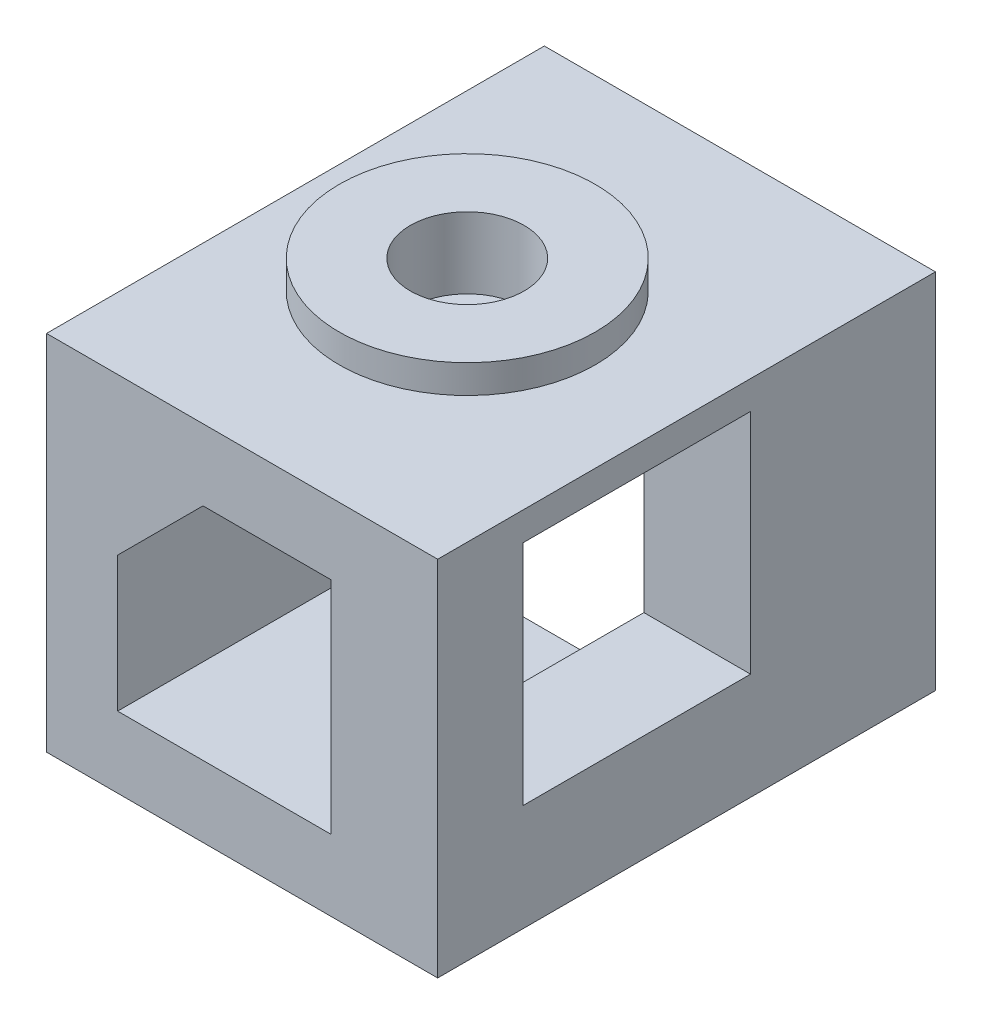
ISO-10303-21;
HEADER;
FILE_DESCRIPTION(('STEP AP214'),'2;1');
FILE_NAME('part.step','',(''),(''),'','','');
FILE_SCHEMA(('AUTOMOTIVE_DESIGN { 1 0 10303 214 1 1 1 1 }'));
ENDSEC;
DATA;
#1=APPLICATION_CONTEXT('core data for automotive mechanical design processes');
#2=APPLICATION_PROTOCOL_DEFINITION('international standard','automotive_design',2000,#1);
#3=PRODUCT_CONTEXT('',#1,'mechanical');
#4=PRODUCT('Part','Part','',(#3));
#5=PRODUCT_RELATED_PRODUCT_CATEGORY('part','',(#4));
#6=PRODUCT_DEFINITION_FORMATION('','',#4);
#7=PRODUCT_DEFINITION_CONTEXT('part definition',#1,'design');
#8=PRODUCT_DEFINITION('design','',#6,#7);
#9=PRODUCT_DEFINITION_SHAPE('','',#8);
#10=(LENGTH_UNIT() NAMED_UNIT(*) SI_UNIT(.MILLI.,.METRE.));
#11=(NAMED_UNIT(*) PLANE_ANGLE_UNIT() SI_UNIT($,.RADIAN.));
#12=(NAMED_UNIT(*) SI_UNIT($,.STERADIAN.) SOLID_ANGLE_UNIT());
#13=UNCERTAINTY_MEASURE_WITH_UNIT(LENGTH_MEASURE(1.E-05),#10,'distance_accuracy_value','');
#14=(GEOMETRIC_REPRESENTATION_CONTEXT(3) GLOBAL_UNCERTAINTY_ASSIGNED_CONTEXT((#13)) GLOBAL_UNIT_ASSIGNED_CONTEXT((#10,
#11,#12)) REPRESENTATION_CONTEXT('',''));
#15=CARTESIAN_POINT('',(0.,0.,0.));
#16=DIRECTION('',(0.,0.,1.));
#17=DIRECTION('',(1.,0.,0.));
#18=AXIS2_PLACEMENT_3D('',#15,#16,#17);
#19=CARTESIAN_POINT('',(-4.30557410186496,-6.26438847045866,35.));
#20=DIRECTION('',(-1.,0.,0.));
#21=DIRECTION('',(0.,-1.,0.));
#22=AXIS2_PLACEMENT_3D('',#19,#20,#21);
#23=PLANE('',#22);
#24=DIRECTION('',(0.,0.,1.));
#25=VECTOR('',#24,1.);
#26=CARTESIAN_POINT('',(-4.30557410186496,-15.7643884704587,35.));
#27=LINE('',#26,#25);
#28=CARTESIAN_POINT('',(-4.30557410186496,-15.7643884704587,15.));
#29=VERTEX_POINT('',#28);
#30=CARTESIAN_POINT('',(-4.30557410186496,-15.7643884704587,35.));
#31=VERTEX_POINT('',#30);
#32=EDGE_CURVE('E206',#29,#31,#27,.T.);
#33=ORIENTED_EDGE('',*,*,#32,.F.);
#34=DIRECTION('',(0.,1.,0.));
#35=VECTOR('',#34,1.);
#36=CARTESIAN_POINT('',(-4.30557410186496,-41.379916598547,15.));
#37=LINE('',#36,#35);
#38=CARTESIAN_POINT('',(-4.30557410186496,-13.2643884704587,15.));
#39=VERTEX_POINT('',#38);
#40=EDGE_CURVE('E239',#29,#39,#37,.T.);
#41=ORIENTED_EDGE('',*,*,#40,.T.);
#42=DIRECTION('',(0.,0.,-1.));
#43=VECTOR('',#42,1.);
#44=CARTESIAN_POINT('',(-4.30557410186496,-13.2643884704587,35.));
#45=LINE('',#44,#43);
#46=CARTESIAN_POINT('',(-4.30557410186496,-13.2643884704587,0.));
#47=VERTEX_POINT('',#46);
#48=EDGE_CURVE('E340',#39,#47,#45,.T.);
#49=ORIENTED_EDGE('',*,*,#48,.T.);
#50=DIRECTION('',(0.,1.,0.));
#51=VECTOR('',#50,1.);
#52=CARTESIAN_POINT('',(-4.30557410186496,-6.26438847045866,0.));
#53=LINE('',#52,#51);
#54=CARTESIAN_POINT('',(-4.30557410186496,-6.26438847045866,0.));
#55=VERTEX_POINT('',#54);
#56=EDGE_CURVE('E311',#47,#55,#53,.T.);
#57=ORIENTED_EDGE('',*,*,#56,.T.);
#58=DIRECTION('',(0.,0.,-1.));
#59=VECTOR('',#58,1.);
#60=CARTESIAN_POINT('',(-4.30557410186496,-6.26438847045866,35.));
#61=LINE('',#60,#59);
#62=CARTESIAN_POINT('',(-4.30557410186496,-6.26438847045866,35.));
#63=VERTEX_POINT('',#62);
#64=EDGE_CURVE('E337',#63,#55,#61,.T.);
#65=ORIENTED_EDGE('',*,*,#64,.F.);
#66=DIRECTION('',(0.,1.,0.));
#67=VECTOR('',#66,1.);
#68=CARTESIAN_POINT('',(-4.30557410186496,-6.26438847045866,35.));
#69=LINE('',#68,#67);
#70=EDGE_CURVE('E286',#31,#63,#69,.T.);
#71=ORIENTED_EDGE('',*,*,#70,.F.);
#72=EDGE_LOOP('',(#33,#41,#49,#57,#65,#71));
#73=FACE_BOUND('',#72,.T.);
#74=ADVANCED_FACE('F43',(#73),#23,.F.);
#75=CARTESIAN_POINT('',(10.694425898135,-20.7643884704587,35.));
#76=DIRECTION('',(1.,0.,0.));
#77=DIRECTION('',(0.,1.,0.));
#78=AXIS2_PLACEMENT_3D('',#75,#76,#77);
#79=PLANE('',#78);
#80=DIRECTION('',(0.,0.,1.));
#81=VECTOR('',#80,1.);
#82=CARTESIAN_POINT('',(10.694425898135,-13.2643884704587,29.));
#83=LINE('',#82,#81);
#84=CARTESIAN_POINT('',(10.694425898135,-13.2643884704587,13.));
#85=VERTEX_POINT('',#84);
#86=CARTESIAN_POINT('',(10.694425898135,-13.2643884704587,29.));
#87=VERTEX_POINT('',#86);
#88=EDGE_CURVE('E410',#85,#87,#83,.T.);
#89=ORIENTED_EDGE('',*,*,#88,.F.);
#90=DIRECTION('',(0.,-1.,0.));
#91=VECTOR('',#90,1.);
#92=CARTESIAN_POINT('',(10.694425898135,2.73561152954134,13.));
#93=LINE('',#92,#91);
#94=CARTESIAN_POINT('',(10.694425898135,-0.264388470458662,13.));
#95=VERTEX_POINT('',#94);
#96=EDGE_CURVE('E407',#95,#85,#93,.T.);
#97=ORIENTED_EDGE('',*,*,#96,.F.);
#98=DIRECTION('',(0.,0.,-1.));
#99=VECTOR('',#98,1.);
#100=CARTESIAN_POINT('',(10.694425898135,-0.264388470458662,35.));
#101=LINE('',#100,#99);
#102=CARTESIAN_POINT('',(10.694425898135,-0.264388470458662,0.));
#103=VERTEX_POINT('',#102);
#104=EDGE_CURVE('E235',#95,#103,#101,.T.);
#105=ORIENTED_EDGE('',*,*,#104,.T.);
#106=DIRECTION('',(0.,1.,0.));
#107=VECTOR('',#106,1.);
#108=CARTESIAN_POINT('',(10.694425898135,-20.7643884704587,0.));
#109=LINE('',#108,#107);
#110=CARTESIAN_POINT('',(10.694425898135,-20.7643884704587,0.));
#111=VERTEX_POINT('',#110);
#112=EDGE_CURVE('E258',#111,#103,#109,.T.);
#113=ORIENTED_EDGE('',*,*,#112,.F.);
#114=DIRECTION('',(0.,0.,-1.));
#115=VECTOR('',#114,1.);
#116=CARTESIAN_POINT('',(10.694425898135,-20.7643884704587,35.));
#117=LINE('',#116,#115);
#118=CARTESIAN_POINT('',(10.694425898135,-20.7643884704587,15.));
#119=VERTEX_POINT('',#118);
#120=EDGE_CURVE('E251',#119,#111,#117,.T.);
#121=ORIENTED_EDGE('',*,*,#120,.F.);
#122=DIRECTION('',(0.,1.,0.));
#123=VECTOR('',#122,1.);
#124=CARTESIAN_POINT('',(10.694425898135,-20.7643884704587,15.));
#125=LINE('',#124,#123);
#126=CARTESIAN_POINT('',(10.694425898135,-15.7643884704587,15.));
#127=VERTEX_POINT('',#126);
#128=EDGE_CURVE('E212',#119,#127,#125,.T.);
#129=ORIENTED_EDGE('',*,*,#128,.T.);
#130=DIRECTION('',(0.,0.,1.));
#131=VECTOR('',#130,1.);
#132=CARTESIAN_POINT('',(10.694425898135,-15.7643884704587,35.));
#133=LINE('',#132,#131);
#134=CARTESIAN_POINT('',(10.694425898135,-15.7643884704587,35.));
#135=VERTEX_POINT('',#134);
#136=EDGE_CURVE('E210',#127,#135,#133,.T.);
#137=ORIENTED_EDGE('',*,*,#136,.T.);
#138=DIRECTION('',(0.,1.,0.));
#139=VECTOR('',#138,1.);
#140=CARTESIAN_POINT('',(10.694425898135,-20.7643884704587,35.));
#141=LINE('',#140,#139);
#142=CARTESIAN_POINT('',(10.694425898135,-0.264388470458662,35.));
#143=VERTEX_POINT('',#142);
#144=EDGE_CURVE('E266',#135,#143,#141,.T.);
#145=ORIENTED_EDGE('',*,*,#144,.T.);
#146=CARTESIAN_POINT('',(10.694425898135,-0.264388470458662,29.));
#147=VERTEX_POINT('',#146);
#148=EDGE_CURVE('E248',#143,#147,#101,.T.);
#149=ORIENTED_EDGE('',*,*,#148,.T.);
#150=DIRECTION('',(0.,1.,0.));
#151=VECTOR('',#150,1.);
#152=CARTESIAN_POINT('',(10.694425898135,2.73561152954134,29.));
#153=LINE('',#152,#151);
#154=EDGE_CURVE('E60',#87,#147,#153,.T.);
#155=ORIENTED_EDGE('',*,*,#154,.F.);
#156=EDGE_LOOP('',(#89,#97,#105,#113,#121,#129,#137,#145,#149,#155));
#157=FACE_BOUND('',#156,.T.);
#158=ADVANCED_FACE('F382',(#157),#79,.F.);
#159=CARTESIAN_POINT('',(-4.30557410186496,-13.2643884704587,35.));
#160=DIRECTION('',(0.,1.,0.));
#161=DIRECTION('',(0.,0.,1.));
#162=AXIS2_PLACEMENT_3D('',#159,#160,#161);
#163=PLANE('',#162);
#164=DIRECTION('',(1.,0.,0.));
#165=VECTOR('',#164,1.);
#166=CARTESIAN_POINT('',(-9.30557410186496,-13.2643884704587,15.));
#167=LINE('',#166,#165);
#168=CARTESIAN_POINT('',(-9.30557410186496,-13.2643884704587,15.));
#169=VERTEX_POINT('',#168);
#170=EDGE_CURVE('E216',#169,#39,#167,.T.);
#171=ORIENTED_EDGE('',*,*,#170,.F.);
#172=DIRECTION('',(0.,0.,-1.));
#173=VECTOR('',#172,1.);
#174=CARTESIAN_POINT('',(-9.30557410186496,-13.2643884704587,35.));
#175=LINE('',#174,#173);
#176=CARTESIAN_POINT('',(-9.30557410186496,-13.2643884704587,0.));
#177=VERTEX_POINT('',#176);
#178=EDGE_CURVE('E47',#169,#177,#175,.T.);
#179=ORIENTED_EDGE('',*,*,#178,.T.);
#180=DIRECTION('',(1.,0.,0.));
#181=VECTOR('',#180,1.);
#182=CARTESIAN_POINT('',(-4.30557410186496,-13.2643884704587,0.));
#183=LINE('',#182,#181);
#184=EDGE_CURVE('E307',#177,#47,#183,.T.);
#185=ORIENTED_EDGE('',*,*,#184,.T.);
#186=ORIENTED_EDGE('',*,*,#48,.F.);
#187=EDGE_LOOP('',(#171,#179,#185,#186));
#188=FACE_BOUND('',#187,.T.);
#189=ADVANCED_FACE('F349',(#188),#163,.F.);
#190=CARTESIAN_POINT('',(18.194425898135,-0.264388470458661,35.));
#191=DIRECTION('',(0.,1.,0.));
#192=DIRECTION('',(-1.,0.,0.));
#193=AXIS2_PLACEMENT_3D('',#190,#191,#192);
#194=PLANE('',#193);
#195=ORIENTED_EDGE('',*,*,#148,.F.);
#196=DIRECTION('',(1.,0.,0.));
#197=VECTOR('',#196,1.);
#198=CARTESIAN_POINT('',(18.194425898135,-0.264388470458661,35.));
#199=LINE('',#198,#197);
#200=CARTESIAN_POINT('',(1.69442589813504,-0.264388470458664,35.));
#201=VERTEX_POINT('',#200);
#202=EDGE_CURVE('E293',#201,#143,#199,.T.);
#203=ORIENTED_EDGE('',*,*,#202,.F.);
#204=DIRECTION('',(0.,0.,-1.));
#205=VECTOR('',#204,1.);
#206=CARTESIAN_POINT('',(1.69442589813504,-0.264388470458664,35.));
#207=LINE('',#206,#205);
#208=CARTESIAN_POINT('',(1.69442589813504,-0.264388470458664,0.));
#209=VERTEX_POINT('',#208);
#210=EDGE_CURVE('E333',#201,#209,#207,.T.);
#211=ORIENTED_EDGE('',*,*,#210,.T.);
#212=DIRECTION('',(1.,0.,0.));
#213=VECTOR('',#212,1.);
#214=CARTESIAN_POINT('',(18.194425898135,-0.264388470458661,0.));
#215=LINE('',#214,#213);
#216=EDGE_CURVE('E317',#209,#103,#215,.T.);
#217=ORIENTED_EDGE('',*,*,#216,.T.);
#218=ORIENTED_EDGE('',*,*,#104,.F.);
#219=EDGE_CURVE('E262',#147,#95,#101,.T.);
#220=ORIENTED_EDGE('',*,*,#219,.F.);
#221=EDGE_LOOP('',(#195,#203,#211,#217,#218,#220));
#222=FACE_BOUND('',#221,.T.);
#223=ADVANCED_FACE('F388',(#222),#194,.F.);
#224=CARTESIAN_POINT('',(-9.30557410186496,-13.2643884704587,35.));
#225=DIRECTION('',(1.,0.,0.));
#226=DIRECTION('',(0.,1.,0.));
#227=AXIS2_PLACEMENT_3D('',#224,#225,#226);
#228=PLANE('',#227);
#229=DIRECTION('',(0.,-1.,0.));
#230=VECTOR('',#229,1.);
#231=CARTESIAN_POINT('',(-9.30557410186496,-13.2643884704587,0.));
#232=LINE('',#231,#230);
#233=CARTESIAN_POINT('',(-9.30557410186496,4.73561152954134,0.));
#234=VERTEX_POINT('',#233);
#235=EDGE_CURVE('E280',#234,#177,#232,.T.);
#236=ORIENTED_EDGE('',*,*,#235,.T.);
#237=ORIENTED_EDGE('',*,*,#178,.F.);
#238=DIRECTION('',(0.,1.,0.));
#239=VECTOR('',#238,1.);
#240=CARTESIAN_POINT('',(-9.30557410186496,-41.379916598547,15.));
#241=LINE('',#240,#239);
#242=CARTESIAN_POINT('',(-9.30557410186496,-20.7643884704587,15.));
#243=VERTEX_POINT('',#242);
#244=EDGE_CURVE('E231',#243,#169,#241,.T.);
#245=ORIENTED_EDGE('',*,*,#244,.F.);
#246=DIRECTION('',(0.,0.,1.));
#247=VECTOR('',#246,1.);
#248=CARTESIAN_POINT('',(-9.30557410186496,-20.7643884704587,35.));
#249=LINE('',#248,#247);
#250=CARTESIAN_POINT('',(-9.30557410186496,-20.7643884704587,35.));
#251=VERTEX_POINT('',#250);
#252=EDGE_CURVE('E230',#243,#251,#249,.T.);
#253=ORIENTED_EDGE('',*,*,#252,.T.);
#254=DIRECTION('',(0.,-1.,0.));
#255=VECTOR('',#254,1.);
#256=CARTESIAN_POINT('',(-9.30557410186496,-13.2643884704587,35.));
#257=LINE('',#256,#255);
#258=CARTESIAN_POINT('',(-9.30557410186496,4.73561152954134,35.));
#259=VERTEX_POINT('',#258);
#260=EDGE_CURVE('E282',#259,#251,#257,.T.);
#261=ORIENTED_EDGE('',*,*,#260,.F.);
#262=DIRECTION('',(0.,0.,-1.));
#263=VECTOR('',#262,1.);
#264=CARTESIAN_POINT('',(-9.30557410186496,4.73561152954134,35.));
#265=LINE('',#264,#263);
#266=EDGE_CURVE('E303',#259,#234,#265,.T.);
#267=ORIENTED_EDGE('',*,*,#266,.T.);
#268=EDGE_LOOP('',(#236,#237,#245,#253,#261,#267));
#269=FACE_BOUND('',#268,.T.);
#270=ADVANCED_FACE('F45',(#269),#228,.F.);
#271=CARTESIAN_POINT('',(1.69442589813504,-0.264388470458664,35.));
#272=DIRECTION('',(-0.707106781186548,0.707106781186548,0.));
#273=DIRECTION('',(-0.707106781186548,-0.707106781186548,0.));
#274=AXIS2_PLACEMENT_3D('',#271,#272,#273);
#275=PLANE('',#274);
#276=DIRECTION('',(0.707106781186548,0.707106781186548,0.));
#277=VECTOR('',#276,1.);
#278=CARTESIAN_POINT('',(1.69442589813504,-0.264388470458664,0.));
#279=LINE('',#278,#277);
#280=EDGE_CURVE('E314',#55,#209,#279,.T.);
#281=ORIENTED_EDGE('',*,*,#280,.T.);
#282=ORIENTED_EDGE('',*,*,#210,.F.);
#283=DIRECTION('',(0.707106781186548,0.707106781186548,0.));
#284=VECTOR('',#283,1.);
#285=CARTESIAN_POINT('',(1.69442589813504,-0.264388470458664,35.));
#286=LINE('',#285,#284);
#287=EDGE_CURVE('E290',#63,#201,#286,.T.);
#288=ORIENTED_EDGE('',*,*,#287,.F.);
#289=ORIENTED_EDGE('',*,*,#64,.T.);
#290=EDGE_LOOP('',(#281,#282,#288,#289));
#291=FACE_BOUND('',#290,.T.);
#292=ADVANCED_FACE('F394',(#291),#275,.F.);
#293=CARTESIAN_POINT('',(18.194425898135,4.73561152954134,35.));
#294=DIRECTION('',(-1.,0.,0.));
#295=DIRECTION('',(0.,0.,1.));
#296=AXIS2_PLACEMENT_3D('',#293,#294,#295);
#297=PLANE('',#296);
#298=DIRECTION('',(0.,0.,1.));
#299=VECTOR('',#298,1.);
#300=CARTESIAN_POINT('',(18.194425898135,2.73561152954134,29.));
#301=LINE('',#300,#299);
#302=CARTESIAN_POINT('',(18.194425898135,2.73561152954134,13.));
#303=VERTEX_POINT('',#302);
#304=CARTESIAN_POINT('',(18.194425898135,2.73561152954134,29.));
#305=VERTEX_POINT('',#304);
#306=EDGE_CURVE('E179',#303,#305,#301,.T.);
#307=ORIENTED_EDGE('',*,*,#306,.F.);
#308=DIRECTION('',(0.,1.,0.));
#309=VECTOR('',#308,1.);
#310=CARTESIAN_POINT('',(18.194425898135,2.73561152954134,13.));
#311=LINE('',#310,#309);
#312=CARTESIAN_POINT('',(18.194425898135,-13.2643884704587,13.));
#313=VERTEX_POINT('',#312);
#314=EDGE_CURVE('E68',#313,#303,#311,.T.);
#315=ORIENTED_EDGE('',*,*,#314,.F.);
#316=DIRECTION('',(0.,0.,-1.));
#317=VECTOR('',#316,1.);
#318=CARTESIAN_POINT('',(18.194425898135,-13.2643884704587,29.));
#319=LINE('',#318,#317);
#320=CARTESIAN_POINT('',(18.194425898135,-13.2643884704587,29.));
#321=VERTEX_POINT('',#320);
#322=EDGE_CURVE('E187',#321,#313,#319,.T.);
#323=ORIENTED_EDGE('',*,*,#322,.F.);
#324=DIRECTION('',(0.,-1.,0.));
#325=VECTOR('',#324,1.);
#326=CARTESIAN_POINT('',(18.194425898135,2.73561152954134,29.));
#327=LINE('',#326,#325);
#328=EDGE_CURVE('E169',#305,#321,#327,.T.);
#329=ORIENTED_EDGE('',*,*,#328,.F.);
#330=EDGE_LOOP('',(#307,#315,#323,#329));
#331=FACE_BOUND('',#330,.T.);
#332=DIRECTION('',(0.,1.,0.));
#333=VECTOR('',#332,1.);
#334=CARTESIAN_POINT('',(18.194425898135,4.73561152954134,0.));
#335=LINE('',#334,#333);
#336=CARTESIAN_POINT('',(18.194425898135,-20.7643884704587,0.));
#337=VERTEX_POINT('',#336);
#338=CARTESIAN_POINT('',(18.194425898135,4.73561152954134,0.));
#339=VERTEX_POINT('',#338);
#340=EDGE_CURVE('E321',#337,#339,#335,.T.);
#341=ORIENTED_EDGE('',*,*,#340,.T.);
#342=DIRECTION('',(0.,0.,-1.));
#343=VECTOR('',#342,1.);
#344=CARTESIAN_POINT('',(18.194425898135,4.73561152954134,35.));
#345=LINE('',#344,#343);
#346=CARTESIAN_POINT('',(18.194425898135,4.73561152954134,35.));
#347=VERTEX_POINT('',#346);
#348=EDGE_CURVE('E330',#347,#339,#345,.T.);
#349=ORIENTED_EDGE('',*,*,#348,.F.);
#350=DIRECTION('',(0.,1.,0.));
#351=VECTOR('',#350,1.);
#352=CARTESIAN_POINT('',(18.194425898135,4.73561152954134,35.));
#353=LINE('',#352,#351);
#354=CARTESIAN_POINT('',(18.194425898135,-20.7643884704587,35.));
#355=VERTEX_POINT('',#354);
#356=EDGE_CURVE('E297',#355,#347,#353,.T.);
#357=ORIENTED_EDGE('',*,*,#356,.F.);
#358=DIRECTION('',(0.,0.,1.));
#359=VECTOR('',#358,1.);
#360=CARTESIAN_POINT('',(18.194425898135,-20.7643884704587,35.));
#361=LINE('',#360,#359);
#362=EDGE_CURVE('E244',#337,#355,#361,.T.);
#363=ORIENTED_EDGE('',*,*,#362,.F.);
#364=EDGE_LOOP('',(#341,#349,#357,#363));
#365=FACE_BOUND('',#364,.T.);
#366=ADVANCED_FACE('F184',(#331,#365),#297,.F.);
#367=CARTESIAN_POINT('',(-9.30557410186496,4.73561152954134,35.));
#368=DIRECTION('',(0.,-1.,0.));
#369=DIRECTION('',(1.,0.,0.));
#370=AXIS2_PLACEMENT_3D('',#367,#368,#369);
#371=PLANE('',#370);
#372=ORIENTED_EDGE('',*,*,#348,.T.);
#373=DIRECTION('',(-1.,0.,0.));
#374=VECTOR('',#373,1.);
#375=CARTESIAN_POINT('',(-9.30557410186496,4.73561152954134,0.));
#376=LINE('',#375,#374);
#377=EDGE_CURVE('E287',#339,#234,#376,.T.);
#378=ORIENTED_EDGE('',*,*,#377,.T.);
#379=ORIENTED_EDGE('',*,*,#266,.F.);
#380=DIRECTION('',(-1.,0.,0.));
#381=VECTOR('',#380,1.);
#382=CARTESIAN_POINT('',(-9.30557410186496,4.73561152954134,35.));
#383=LINE('',#382,#381);
#384=EDGE_CURVE('E300',#347,#259,#383,.T.);
#385=ORIENTED_EDGE('',*,*,#384,.F.);
#386=EDGE_LOOP('',(#372,#378,#379,#385));
#387=FACE_BOUND('',#386,.T.);
#388=CARTESIAN_POINT('',(2.90442589813504,4.73561152954134,17.63));
#389=DIRECTION('',(0.,1.,0.));
#390=DIRECTION('',(-1.,0.,0.));
#391=AXIS2_PLACEMENT_3D('',#388,#389,#390);
#392=CIRCLE('',#391,9.);
#393=CARTESIAN_POINT('',(-6.09557410186496,4.73561152954134,17.63));
#394=VERTEX_POINT('',#393);
#395=EDGE_CURVE('E11',#394,#394,#392,.T.);
#396=ORIENTED_EDGE('',*,*,#395,.F.);
#397=EDGE_LOOP('',(#396));
#398=FACE_BOUND('',#397,.T.);
#399=ADVANCED_FACE('F362',(#387,#398),#371,.F.);
#400=CARTESIAN_POINT('',(0.,0.,35.));
#401=DIRECTION('',(0.,0.,-1.));
#402=DIRECTION('',(-1.,0.,0.));
#403=AXIS2_PLACEMENT_3D('',#400,#401,#402);
#404=PLANE('',#403);
#405=DIRECTION('',(-1.,0.,0.));
#406=VECTOR('',#405,1.);
#407=CARTESIAN_POINT('',(31.3099540262233,-15.7643884704587,35.));
#408=LINE('',#407,#406);
#409=EDGE_CURVE('E204',#135,#31,#408,.T.);
#410=ORIENTED_EDGE('',*,*,#409,.T.);
#411=ORIENTED_EDGE('',*,*,#70,.T.);
#412=ORIENTED_EDGE('',*,*,#287,.T.);
#413=ORIENTED_EDGE('',*,*,#202,.T.);
#414=ORIENTED_EDGE('',*,*,#144,.F.);
#415=EDGE_LOOP('',(#410,#411,#412,#413,#414));
#416=FACE_BOUND('',#415,.T.);
#417=ORIENTED_EDGE('',*,*,#260,.T.);
#418=DIRECTION('',(-1.,0.,0.));
#419=VECTOR('',#418,1.);
#420=CARTESIAN_POINT('',(18.194425898135,-20.7643884704587,35.));
#421=LINE('',#420,#419);
#422=EDGE_CURVE('E247',#355,#251,#421,.T.);
#423=ORIENTED_EDGE('',*,*,#422,.F.);
#424=ORIENTED_EDGE('',*,*,#356,.T.);
#425=ORIENTED_EDGE('',*,*,#384,.T.);
#426=EDGE_LOOP('',(#417,#423,#424,#425));
#427=FACE_BOUND('',#426,.T.);
#428=ADVANCED_FACE('F374',(#416,#427),#404,.F.);
#429=CARTESIAN_POINT('',(0.,0.,0.));
#430=DIRECTION('',(0.,0.,-1.));
#431=DIRECTION('',(-1.,0.,0.));
#432=AXIS2_PLACEMENT_3D('',#429,#430,#431);
#433=PLANE('',#432);
#434=ORIENTED_EDGE('',*,*,#112,.T.);
#435=ORIENTED_EDGE('',*,*,#216,.F.);
#436=ORIENTED_EDGE('',*,*,#280,.F.);
#437=ORIENTED_EDGE('',*,*,#56,.F.);
#438=ORIENTED_EDGE('',*,*,#184,.F.);
#439=ORIENTED_EDGE('',*,*,#235,.F.);
#440=ORIENTED_EDGE('',*,*,#377,.F.);
#441=ORIENTED_EDGE('',*,*,#340,.F.);
#442=DIRECTION('',(1.,0.,0.));
#443=VECTOR('',#442,1.);
#444=CARTESIAN_POINT('',(18.194425898135,-20.7643884704587,0.));
#445=LINE('',#444,#443);
#446=EDGE_CURVE('E254',#111,#337,#445,.T.);
#447=ORIENTED_EDGE('',*,*,#446,.F.);
#448=EDGE_LOOP('',(#434,#435,#436,#437,#438,#439,#440,#441,#447));
#449=FACE_BOUND('',#448,.T.);
#450=ADVANCED_FACE('F355',(#449),#433,.T.);
#451=CARTESIAN_POINT('',(2.90442589813504,6.73561152954134,17.63));
#452=DIRECTION('',(0.,-1.,0.));
#453=DIRECTION('',(1.,0.,0.));
#454=AXIS2_PLACEMENT_3D('',#451,#452,#453);
#455=CYLINDRICAL_SURFACE('',#454,9.);
#456=CARTESIAN_POINT('',(2.90442589813504,6.73561152954134,17.63));
#457=DIRECTION('',(0.,1.,0.));
#458=DIRECTION('',(-1.,0.,0.));
#459=AXIS2_PLACEMENT_3D('',#456,#457,#458);
#460=CIRCLE('',#459,9.);
#461=CARTESIAN_POINT('',(-6.09557410186496,6.73561152954134,17.63));
#462=VERTEX_POINT('',#461);
#463=EDGE_CURVE('E274',#462,#462,#460,.T.);
#464=ORIENTED_EDGE('',*,*,#463,.F.);
#465=EDGE_LOOP('',(#464));
#466=FACE_BOUND('',#465,.T.);
#467=ORIENTED_EDGE('',*,*,#395,.T.);
#468=EDGE_LOOP('',(#467));
#469=FACE_BOUND('',#468,.T.);
#470=ADVANCED_FACE('F452',(#466,#469),#455,.T.);
#471=CARTESIAN_POINT('',(2.90442589813504,6.73561152954134,17.63));
#472=DIRECTION('',(0.,1.,0.));
#473=DIRECTION('',(-1.,0.,0.));
#474=AXIS2_PLACEMENT_3D('',#471,#472,#473);
#475=PLANE('',#474);
#476=CARTESIAN_POINT('',(2.90442589813504,6.73561152954134,17.63));
#477=DIRECTION('',(0.,1.,0.));
#478=DIRECTION('',(-1.,0.,0.));
#479=AXIS2_PLACEMENT_3D('',#476,#477,#478);
#480=CIRCLE('',#479,4.);
#481=CARTESIAN_POINT('',(-1.09557410186496,6.73561152954134,17.63));
#482=VERTEX_POINT('',#481);
#483=EDGE_CURVE('E269',#482,#482,#480,.T.);
#484=ORIENTED_EDGE('',*,*,#483,.F.);
#485=EDGE_LOOP('',(#484));
#486=FACE_BOUND('',#485,.T.);
#487=ORIENTED_EDGE('',*,*,#463,.T.);
#488=EDGE_LOOP('',(#487));
#489=FACE_BOUND('',#488,.T.);
#490=ADVANCED_FACE('F457',(#486,#489),#475,.T.);
#491=CARTESIAN_POINT('',(2.90442589813504,1.73561152954134,17.63));
#492=DIRECTION('',(0.,1.,0.));
#493=DIRECTION('',(-1.,0.,0.));
#494=AXIS2_PLACEMENT_3D('',#491,#492,#493);
#495=CYLINDRICAL_SURFACE('',#494,4.);
#496=CARTESIAN_POINT('',(2.90442589813504,1.73561152954134,17.63));
#497=DIRECTION('',(0.,1.,0.));
#498=DIRECTION('',(-1.,0.,0.));
#499=AXIS2_PLACEMENT_3D('',#496,#497,#498);
#500=CIRCLE('',#499,4.);
#501=CARTESIAN_POINT('',(-1.09557410186496,1.73561152954134,17.63));
#502=VERTEX_POINT('',#501);
#503=EDGE_CURVE('E270',#502,#502,#500,.T.);
#504=ORIENTED_EDGE('',*,*,#503,.F.);
#505=EDGE_LOOP('',(#504));
#506=FACE_BOUND('',#505,.T.);
#507=ORIENTED_EDGE('',*,*,#483,.T.);
#508=EDGE_LOOP('',(#507));
#509=FACE_BOUND('',#508,.T.);
#510=ADVANCED_FACE('F461',(#506,#509),#495,.F.);
#511=CARTESIAN_POINT('',(2.90442589813504,1.73561152954134,17.63));
#512=DIRECTION('',(0.,1.,0.));
#513=DIRECTION('',(-1.,0.,0.));
#514=AXIS2_PLACEMENT_3D('',#511,#512,#513);
#515=PLANE('',#514);
#516=ORIENTED_EDGE('',*,*,#503,.T.);
#517=EDGE_LOOP('',(#516));
#518=FACE_BOUND('',#517,.T.);
#519=ADVANCED_FACE('F465',(#518),#515,.T.);
#520=CARTESIAN_POINT('',(0.,-20.7643884704587,0.));
#521=DIRECTION('',(0.,1.,0.));
#522=DIRECTION('',(-1.,0.,0.));
#523=AXIS2_PLACEMENT_3D('',#520,#521,#522);
#524=PLANE('',#523);
#525=ORIENTED_EDGE('',*,*,#362,.T.);
#526=ORIENTED_EDGE('',*,*,#422,.T.);
#527=ORIENTED_EDGE('',*,*,#252,.F.);
#528=DIRECTION('',(-1.,0.,0.));
#529=VECTOR('',#528,1.);
#530=CARTESIAN_POINT('',(-9.30557410186496,-20.7643884704587,15.));
#531=LINE('',#530,#529);
#532=EDGE_CURVE('E226',#119,#243,#531,.T.);
#533=ORIENTED_EDGE('',*,*,#532,.F.);
#534=ORIENTED_EDGE('',*,*,#120,.T.);
#535=ORIENTED_EDGE('',*,*,#446,.T.);
#536=EDGE_LOOP('',(#525,#526,#527,#533,#534,#535));
#537=FACE_BOUND('',#536,.T.);
#538=ADVANCED_FACE('F368',(#537),#524,.F.);
#539=CARTESIAN_POINT('',(-9.30557410186496,-41.379916598547,15.));
#540=DIRECTION('',(0.,0.,1.));
#541=DIRECTION('',(1.,0.,0.));
#542=AXIS2_PLACEMENT_3D('',#539,#540,#541);
#543=PLANE('',#542);
#544=ORIENTED_EDGE('',*,*,#40,.F.);
#545=DIRECTION('',(-1.,0.,0.));
#546=VECTOR('',#545,1.);
#547=CARTESIAN_POINT('',(31.3099540262233,-15.7643884704587,15.));
#548=LINE('',#547,#546);
#549=EDGE_CURVE('E211',#127,#29,#548,.T.);
#550=ORIENTED_EDGE('',*,*,#549,.F.);
#551=ORIENTED_EDGE('',*,*,#128,.F.);
#552=ORIENTED_EDGE('',*,*,#532,.T.);
#553=ORIENTED_EDGE('',*,*,#244,.T.);
#554=ORIENTED_EDGE('',*,*,#170,.T.);
#555=EDGE_LOOP('',(#544,#550,#551,#552,#553,#554));
#556=FACE_BOUND('',#555,.T.);
#557=ADVANCED_FACE('F378',(#556),#543,.F.);
#558=CARTESIAN_POINT('',(31.3099540262233,-15.7643884704587,35.));
#559=DIRECTION('',(0.,-1.,0.));
#560=DIRECTION('',(1.,0.,0.));
#561=AXIS2_PLACEMENT_3D('',#558,#559,#560);
#562=PLANE('',#561);
#563=ORIENTED_EDGE('',*,*,#136,.F.);
#564=ORIENTED_EDGE('',*,*,#549,.T.);
#565=ORIENTED_EDGE('',*,*,#32,.T.);
#566=ORIENTED_EDGE('',*,*,#409,.F.);
#567=EDGE_LOOP('',(#563,#564,#565,#566));
#568=FACE_BOUND('',#567,.T.);
#569=ADVANCED_FACE('F399',(#568),#562,.F.);
#570=CARTESIAN_POINT('',(10.694425898135,-20.7643884704587,35.));
#571=DIRECTION('',(1.,0.,0.));
#572=DIRECTION('',(0.,1.,0.));
#573=AXIS2_PLACEMENT_3D('',#570,#571,#572);
#574=PLANE('',#573);
#575=ORIENTED_EDGE('',*,*,#219,.T.);
#576=CARTESIAN_POINT('',(10.694425898135,2.73561152954134,13.));
#577=VERTEX_POINT('',#576);
#578=EDGE_CURVE('E205',#577,#95,#93,.T.);
#579=ORIENTED_EDGE('',*,*,#578,.F.);
#580=DIRECTION('',(0.,0.,-1.));
#581=VECTOR('',#580,1.);
#582=CARTESIAN_POINT('',(10.694425898135,2.73561152954134,29.));
#583=LINE('',#582,#581);
#584=CARTESIAN_POINT('',(10.694425898135,2.73561152954134,29.));
#585=VERTEX_POINT('',#584);
#586=EDGE_CURVE('E201',#585,#577,#583,.T.);
#587=ORIENTED_EDGE('',*,*,#586,.F.);
#588=EDGE_CURVE('E171',#147,#585,#153,.T.);
#589=ORIENTED_EDGE('',*,*,#588,.F.);
#590=EDGE_LOOP('',(#575,#579,#587,#589));
#591=FACE_BOUND('',#590,.T.);
#592=ADVANCED_FACE('F420',(#591),#574,.T.);
#593=CARTESIAN_POINT('',(-11.9329910998345,2.73561152954134,13.));
#594=DIRECTION('',(0.,0.,-1.));
#595=DIRECTION('',(0.,1.,0.));
#596=AXIS2_PLACEMENT_3D('',#593,#594,#595);
#597=PLANE('',#596);
#598=ORIENTED_EDGE('',*,*,#578,.T.);
#599=ORIENTED_EDGE('',*,*,#96,.T.);
#600=DIRECTION('',(1.,0.,0.));
#601=VECTOR('',#600,1.);
#602=CARTESIAN_POINT('',(-11.9329910998345,-13.2643884704587,13.));
#603=LINE('',#602,#601);
#604=EDGE_CURVE('E194',#85,#313,#603,.T.);
#605=ORIENTED_EDGE('',*,*,#604,.T.);
#606=ORIENTED_EDGE('',*,*,#314,.T.);
#607=DIRECTION('',(1.,0.,0.));
#608=VECTOR('',#607,1.);
#609=CARTESIAN_POINT('',(-11.9329910998345,2.73561152954134,13.));
#610=LINE('',#609,#608);
#611=EDGE_CURVE('E176',#577,#303,#610,.T.);
#612=ORIENTED_EDGE('',*,*,#611,.F.);
#613=EDGE_LOOP('',(#598,#599,#605,#606,#612));
#614=FACE_BOUND('',#613,.T.);
#615=ADVANCED_FACE('F419',(#614),#597,.F.);
#616=CARTESIAN_POINT('',(-11.9329910998345,-13.2643884704587,29.));
#617=DIRECTION('',(0.,-1.,0.));
#618=DIRECTION('',(0.,0.,-1.));
#619=AXIS2_PLACEMENT_3D('',#616,#617,#618);
#620=PLANE('',#619);
#621=ORIENTED_EDGE('',*,*,#88,.T.);
#622=DIRECTION('',(1.,0.,0.));
#623=VECTOR('',#622,1.);
#624=CARTESIAN_POINT('',(-11.9329910998345,-13.2643884704587,29.));
#625=LINE('',#624,#623);
#626=EDGE_CURVE('E175',#87,#321,#625,.T.);
#627=ORIENTED_EDGE('',*,*,#626,.T.);
#628=ORIENTED_EDGE('',*,*,#322,.T.);
#629=ORIENTED_EDGE('',*,*,#604,.F.);
#630=EDGE_LOOP('',(#621,#627,#628,#629));
#631=FACE_BOUND('',#630,.T.);
#632=ADVANCED_FACE('F418',(#631),#620,.F.);
#633=CARTESIAN_POINT('',(-11.9329910998345,2.73561152954134,29.));
#634=DIRECTION('',(0.,0.,1.));
#635=DIRECTION('',(1.,0.,0.));
#636=AXIS2_PLACEMENT_3D('',#633,#634,#635);
#637=PLANE('',#636);
#638=ORIENTED_EDGE('',*,*,#154,.T.);
#639=ORIENTED_EDGE('',*,*,#588,.T.);
#640=DIRECTION('',(1.,0.,0.));
#641=VECTOR('',#640,1.);
#642=CARTESIAN_POINT('',(-11.9329910998345,2.73561152954134,29.));
#643=LINE('',#642,#641);
#644=EDGE_CURVE('E165',#585,#305,#643,.T.);
#645=ORIENTED_EDGE('',*,*,#644,.T.);
#646=ORIENTED_EDGE('',*,*,#328,.T.);
#647=ORIENTED_EDGE('',*,*,#626,.F.);
#648=EDGE_LOOP('',(#638,#639,#645,#646,#647));
#649=FACE_BOUND('',#648,.T.);
#650=ADVANCED_FACE('F167',(#649),#637,.F.);
#651=CARTESIAN_POINT('',(-11.9329910998345,2.73561152954134,29.));
#652=DIRECTION('',(0.,1.,0.));
#653=DIRECTION('',(0.,0.,1.));
#654=AXIS2_PLACEMENT_3D('',#651,#652,#653);
#655=PLANE('',#654);
#656=ORIENTED_EDGE('',*,*,#586,.T.);
#657=ORIENTED_EDGE('',*,*,#611,.T.);
#658=ORIENTED_EDGE('',*,*,#306,.T.);
#659=ORIENTED_EDGE('',*,*,#644,.F.);
#660=EDGE_LOOP('',(#656,#657,#658,#659));
#661=FACE_BOUND('',#660,.T.);
#662=ADVANCED_FACE('F180',(#661),#655,.F.);
#663=CLOSED_SHELL('',(#74,#158,#189,#223,#270,#292,#366,#399,#428,#450,#470,#490,#510,#519,#538,
#557,#569,#592,#615,#632,#650,#662));
#664=MANIFOLD_SOLID_BREP('B2',#663);
#665=ADVANCED_BREP_SHAPE_REPRESENTATION('',(#18,#664),#14);
#666=SHAPE_DEFINITION_REPRESENTATION(#9,#665);
ENDSEC;
END-ISO-10303-21;
